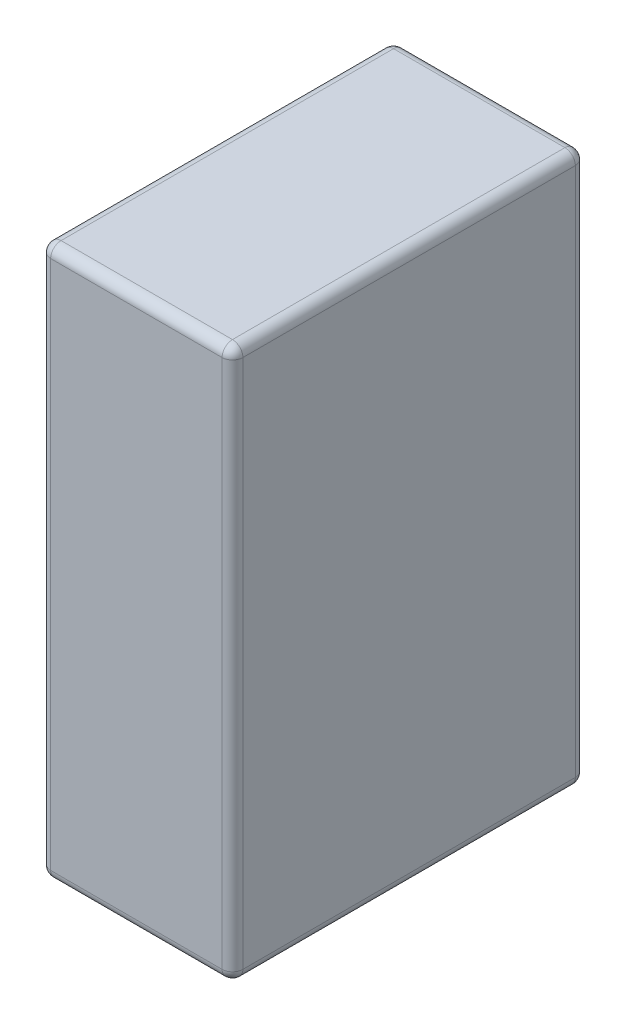
ISO-10303-21;
HEADER;
FILE_DESCRIPTION(('STEP AP214'),'2;1');
FILE_NAME('part.step','',(''),(''),'','','');
FILE_SCHEMA(('AUTOMOTIVE_DESIGN { 1 0 10303 214 1 1 1 1 }'));
ENDSEC;
DATA;
#1=APPLICATION_CONTEXT('core data for automotive mechanical design processes');
#2=APPLICATION_PROTOCOL_DEFINITION('international standard','automotive_design',2000,#1);
#3=PRODUCT_CONTEXT('',#1,'mechanical');
#4=PRODUCT('Part','Part','',(#3));
#5=PRODUCT_RELATED_PRODUCT_CATEGORY('part','',(#4));
#6=PRODUCT_DEFINITION_FORMATION('','',#4);
#7=PRODUCT_DEFINITION_CONTEXT('part definition',#1,'design');
#8=PRODUCT_DEFINITION('design','',#6,#7);
#9=PRODUCT_DEFINITION_SHAPE('','',#8);
#10=(LENGTH_UNIT() NAMED_UNIT(*) SI_UNIT(.MILLI.,.METRE.));
#11=(NAMED_UNIT(*) PLANE_ANGLE_UNIT() SI_UNIT($,.RADIAN.));
#12=(NAMED_UNIT(*) SI_UNIT($,.STERADIAN.) SOLID_ANGLE_UNIT());
#13=UNCERTAINTY_MEASURE_WITH_UNIT(LENGTH_MEASURE(1.E-05),#10,'distance_accuracy_value','');
#14=(GEOMETRIC_REPRESENTATION_CONTEXT(3) GLOBAL_UNCERTAINTY_ASSIGNED_CONTEXT((#13)) GLOBAL_UNIT_ASSIGNED_CONTEXT((#10,
#11,#12)) REPRESENTATION_CONTEXT('',''));
#15=CARTESIAN_POINT('',(0.,0.,0.));
#16=DIRECTION('',(0.,0.,1.));
#17=DIRECTION('',(1.,0.,0.));
#18=AXIS2_PLACEMENT_3D('',#15,#16,#17);
#19=CARTESIAN_POINT('',(-16.5,-51.,32.));
#20=DIRECTION('',(1.,0.,0.));
#21=DIRECTION('',(0.,0.,1.));
#22=AXIS2_PLACEMENT_3D('',#19,#20,#21);
#23=SPHERICAL_SURFACE('',#22,2.);
#24=CARTESIAN_POINT('',(-16.5,-51.,32.));
#25=DIRECTION('',(-1.,0.,0.));
#26=DIRECTION('',(0.,0.,1.));
#27=AXIS2_PLACEMENT_3D('',#24,#25,#26);
#28=CIRCLE('',#27,2.);
#29=CARTESIAN_POINT('',(-16.5,-51.0000000000245,34.));
#30=VERTEX_POINT('',#29);
#31=CARTESIAN_POINT('',(-16.5,-53.,32.));
#32=VERTEX_POINT('',#31);
#33=EDGE_CURVE('E169',#30,#32,#28,.F.);
#34=ORIENTED_EDGE('',*,*,#33,.F.);
#35=CARTESIAN_POINT('',(-16.5,-51.,32.));
#36=DIRECTION('',(0.,-1.,0.));
#37=DIRECTION('',(0.,0.,-1.));
#38=AXIS2_PLACEMENT_3D('',#35,#36,#37);
#39=CIRCLE('',#38,2.);
#40=CARTESIAN_POINT('',(-18.5,-51.,32.));
#41=VERTEX_POINT('',#40);
#42=EDGE_CURVE('E166',#41,#30,#39,.F.);
#43=ORIENTED_EDGE('',*,*,#42,.F.);
#44=CARTESIAN_POINT('',(-16.5,-51.,32.));
#45=DIRECTION('',(0.,0.,-1.));
#46=DIRECTION('',(-1.,0.,0.));
#47=AXIS2_PLACEMENT_3D('',#44,#45,#46);
#48=CIRCLE('',#47,2.);
#49=EDGE_CURVE('E173',#32,#41,#48,.T.);
#50=ORIENTED_EDGE('',*,*,#49,.F.);
#51=EDGE_LOOP('',(#34,#43,#50));
#52=FACE_BOUND('',#51,.T.);
#53=ADVANCED_FACE('F19',(#52),#23,.T.);
#54=CARTESIAN_POINT('',(-16.5,51.,32.));
#55=DIRECTION('',(1.,0.,0.));
#56=DIRECTION('',(0.,1.,0.));
#57=AXIS2_PLACEMENT_3D('',#54,#55,#56);
#58=SPHERICAL_SURFACE('',#57,2.);
#59=CARTESIAN_POINT('',(-16.5,51.,32.));
#60=DIRECTION('',(0.,0.,1.));
#61=DIRECTION('',(1.,0.,0.));
#62=AXIS2_PLACEMENT_3D('',#59,#60,#61);
#63=CIRCLE('',#62,2.);
#64=CARTESIAN_POINT('',(-18.5,51.0000000000736,32.));
#65=VERTEX_POINT('',#64);
#66=CARTESIAN_POINT('',(-16.5,53.,32.));
#67=VERTEX_POINT('',#66);
#68=EDGE_CURVE('E187',#65,#67,#63,.F.);
#69=ORIENTED_EDGE('',*,*,#68,.F.);
#70=CARTESIAN_POINT('',(-16.5,51.0000000000981,32.));
#71=DIRECTION('',(0.,-1.,0.));
#72=DIRECTION('',(0.,0.,-1.));
#73=AXIS2_PLACEMENT_3D('',#70,#71,#72);
#74=CIRCLE('',#73,2.);
#75=CARTESIAN_POINT('',(-16.5,51.0000000000981,34.));
#76=VERTEX_POINT('',#75);
#77=EDGE_CURVE('E175',#76,#65,#74,.T.);
#78=ORIENTED_EDGE('',*,*,#77,.F.);
#79=CARTESIAN_POINT('',(-16.5,51.,32.));
#80=DIRECTION('',(1.,0.,0.));
#81=DIRECTION('',(0.,0.,-1.));
#82=AXIS2_PLACEMENT_3D('',#79,#80,#81);
#83=CIRCLE('',#82,2.);
#84=EDGE_CURVE('E189',#67,#76,#83,.T.);
#85=ORIENTED_EDGE('',*,*,#84,.F.);
#86=EDGE_LOOP('',(#69,#78,#85));
#87=FACE_BOUND('',#86,.T.);
#88=ADVANCED_FACE('F307',(#87),#58,.T.);
#89=CARTESIAN_POINT('',(-16.5,51.,-32.));
#90=DIRECTION('',(1.,0.,0.));
#91=DIRECTION('',(0.,0.,-1.));
#92=AXIS2_PLACEMENT_3D('',#89,#90,#91);
#93=SPHERICAL_SURFACE('',#92,2.);
#94=CARTESIAN_POINT('',(-16.5,51.,-32.));
#95=DIRECTION('',(-1.,0.,0.));
#96=DIRECTION('',(0.,0.,1.));
#97=AXIS2_PLACEMENT_3D('',#94,#95,#96);
#98=CIRCLE('',#97,2.);
#99=CARTESIAN_POINT('',(-16.5,51.,-34.));
#100=VERTEX_POINT('',#99);
#101=CARTESIAN_POINT('',(-16.5,53.,-32.0000000001563));
#102=VERTEX_POINT('',#101);
#103=EDGE_CURVE('E242',#100,#102,#98,.F.);
#104=ORIENTED_EDGE('',*,*,#103,.F.);
#105=CARTESIAN_POINT('',(-16.5,51.,-32.));
#106=DIRECTION('',(0.,-1.,0.));
#107=DIRECTION('',(0.,0.,-1.));
#108=AXIS2_PLACEMENT_3D('',#105,#106,#107);
#109=CIRCLE('',#108,2.);
#110=CARTESIAN_POINT('',(-18.5,51.,-32.));
#111=VERTEX_POINT('',#110);
#112=EDGE_CURVE('E219',#111,#100,#109,.T.);
#113=ORIENTED_EDGE('',*,*,#112,.F.);
#114=CARTESIAN_POINT('',(-16.5,51.,-32.));
#115=DIRECTION('',(0.,0.,1.));
#116=DIRECTION('',(1.,0.,0.));
#117=AXIS2_PLACEMENT_3D('',#114,#115,#116);
#118=CIRCLE('',#117,2.);
#119=EDGE_CURVE('E195',#102,#111,#118,.T.);
#120=ORIENTED_EDGE('',*,*,#119,.F.);
#121=EDGE_LOOP('',(#104,#113,#120));
#122=FACE_BOUND('',#121,.T.);
#123=ADVANCED_FACE('F397',(#122),#93,.T.);
#124=CARTESIAN_POINT('',(-16.5,-51.,-32.));
#125=DIRECTION('',(1.,0.,0.));
#126=DIRECTION('',(0.,-1.,0.));
#127=AXIS2_PLACEMENT_3D('',#124,#125,#126);
#128=SPHERICAL_SURFACE('',#127,1.99999999999998);
#129=CARTESIAN_POINT('',(-16.5,-51.,-32.));
#130=DIRECTION('',(0.,-1.,0.));
#131=DIRECTION('',(0.,0.,-1.));
#132=AXIS2_PLACEMENT_3D('',#129,#130,#131);
#133=CIRCLE('',#132,2.);
#134=CARTESIAN_POINT('',(-16.5,-51.0000000002923,-34.));
#135=VERTEX_POINT('',#134);
#136=CARTESIAN_POINT('',(-18.5,-51.,-32.));
#137=VERTEX_POINT('',#136);
#138=EDGE_CURVE('E214',#135,#137,#133,.F.);
#139=ORIENTED_EDGE('',*,*,#138,.F.);
#140=CARTESIAN_POINT('',(-16.5,-51.,-32.));
#141=DIRECTION('',(1.,0.,0.));
#142=DIRECTION('',(0.,0.,-1.));
#143=AXIS2_PLACEMENT_3D('',#140,#141,#142);
#144=CIRCLE('',#143,2.);
#145=CARTESIAN_POINT('',(-16.5,-53.,-32.));
#146=VERTEX_POINT('',#145);
#147=EDGE_CURVE('E202',#146,#135,#144,.T.);
#148=ORIENTED_EDGE('',*,*,#147,.F.);
#149=CARTESIAN_POINT('',(-16.5,-51.,-32.));
#150=DIRECTION('',(0.,0.,-1.));
#151=DIRECTION('',(-1.,0.,0.));
#152=AXIS2_PLACEMENT_3D('',#149,#150,#151);
#153=CIRCLE('',#152,2.);
#154=EDGE_CURVE('E176',#137,#146,#153,.F.);
#155=ORIENTED_EDGE('',*,*,#154,.F.);
#156=EDGE_LOOP('',(#139,#148,#155));
#157=FACE_BOUND('',#156,.T.);
#158=ADVANCED_FACE('F237',(#157),#128,.T.);
#159=CARTESIAN_POINT('',(-18.5,53.,-34.));
#160=DIRECTION('',(1.,0.,0.));
#161=DIRECTION('',(0.,0.,-1.));
#162=AXIS2_PLACEMENT_3D('',#159,#160,#161);
#163=PLANE('',#162);
#164=DIRECTION('',(0.,0.,1.));
#165=VECTOR('',#164,1.);
#166=CARTESIAN_POINT('',(-18.5,51.,0.));
#167=LINE('',#166,#165);
#168=EDGE_CURVE('E190',#111,#65,#167,.T.);
#169=ORIENTED_EDGE('',*,*,#168,.F.);
#170=DIRECTION('',(0.,-1.,0.));
#171=VECTOR('',#170,1.);
#172=CARTESIAN_POINT('',(-18.5,53.,-32.));
#173=LINE('',#172,#171);
#174=EDGE_CURVE('E150',#137,#111,#173,.F.);
#175=ORIENTED_EDGE('',*,*,#174,.F.);
#176=DIRECTION('',(0.,0.,-1.));
#177=VECTOR('',#176,1.);
#178=CARTESIAN_POINT('',(-18.5,-51.,-34.));
#179=LINE('',#178,#177);
#180=EDGE_CURVE('E208',#41,#137,#179,.T.);
#181=ORIENTED_EDGE('',*,*,#180,.F.);
#182=DIRECTION('',(0.,-1.,0.));
#183=VECTOR('',#182,1.);
#184=CARTESIAN_POINT('',(-18.5,53.,32.));
#185=LINE('',#184,#183);
#186=EDGE_CURVE('E170',#65,#41,#185,.T.);
#187=ORIENTED_EDGE('',*,*,#186,.F.);
#188=EDGE_LOOP('',(#169,#175,#181,#187));
#189=FACE_BOUND('',#188,.T.);
#190=ADVANCED_FACE('F268',(#189),#163,.F.);
#191=CARTESIAN_POINT('',(-16.5,-51.,-34.));
#192=DIRECTION('',(0.,0.,-1.));
#193=DIRECTION('',(-1.,0.,0.));
#194=AXIS2_PLACEMENT_3D('',#191,#192,#193);
#195=CYLINDRICAL_SURFACE('',#194,2.);
#196=DIRECTION('',(0.,0.,-1.));
#197=VECTOR('',#196,1.);
#198=CARTESIAN_POINT('',(-16.5,-53.,0.));
#199=LINE('',#198,#197);
#200=EDGE_CURVE('E149',#32,#146,#199,.T.);
#201=ORIENTED_EDGE('',*,*,#200,.F.);
#202=ORIENTED_EDGE('',*,*,#49,.T.);
#203=ORIENTED_EDGE('',*,*,#180,.T.);
#204=ORIENTED_EDGE('',*,*,#154,.T.);
#205=EDGE_LOOP('',(#201,#202,#203,#204));
#206=FACE_BOUND('',#205,.T.);
#207=ADVANCED_FACE('F226',(#206),#195,.T.);
#208=CARTESIAN_POINT('',(-16.5,53.,32.));
#209=DIRECTION('',(0.,-1.,0.));
#210=DIRECTION('',(0.,0.,-1.));
#211=AXIS2_PLACEMENT_3D('',#208,#209,#210);
#212=CYLINDRICAL_SURFACE('',#211,2.);
#213=ORIENTED_EDGE('',*,*,#42,.T.);
#214=DIRECTION('',(0.,1.,0.));
#215=VECTOR('',#214,1.);
#216=CARTESIAN_POINT('',(-16.5,53.,34.));
#217=LINE('',#216,#215);
#218=EDGE_CURVE('E112',#30,#76,#217,.T.);
#219=ORIENTED_EDGE('',*,*,#218,.T.);
#220=ORIENTED_EDGE('',*,*,#77,.T.);
#221=ORIENTED_EDGE('',*,*,#186,.T.);
#222=EDGE_LOOP('',(#213,#219,#220,#221));
#223=FACE_BOUND('',#222,.T.);
#224=ADVANCED_FACE('F262',(#223),#212,.T.);
#225=CARTESIAN_POINT('',(18.5,-51.,32.));
#226=DIRECTION('',(-1.,0.,0.));
#227=DIRECTION('',(0.,0.,1.));
#228=AXIS2_PLACEMENT_3D('',#225,#226,#227);
#229=CYLINDRICAL_SURFACE('',#228,2.);
#230=DIRECTION('',(-1.,0.,0.));
#231=VECTOR('',#230,1.);
#232=CARTESIAN_POINT('',(18.5,-51.0000000000491,34.));
#233=LINE('',#232,#231);
#234=CARTESIAN_POINT('',(16.5,-51.0000000000245,34.));
#235=VERTEX_POINT('',#234);
#236=EDGE_CURVE('E23',#235,#30,#233,.T.);
#237=ORIENTED_EDGE('',*,*,#236,.T.);
#238=ORIENTED_EDGE('',*,*,#33,.T.);
#239=DIRECTION('',(1.,0.,0.));
#240=VECTOR('',#239,1.);
#241=CARTESIAN_POINT('',(0.,-53.,32.));
#242=LINE('',#241,#240);
#243=CARTESIAN_POINT('',(16.5,-53.,32.));
#244=VERTEX_POINT('',#243);
#245=EDGE_CURVE('E131',#244,#32,#242,.F.);
#246=ORIENTED_EDGE('',*,*,#245,.F.);
#247=CARTESIAN_POINT('',(16.5,-51.,32.));
#248=DIRECTION('',(1.,0.,0.));
#249=DIRECTION('',(0.,0.,-1.));
#250=AXIS2_PLACEMENT_3D('',#247,#248,#249);
#251=CIRCLE('',#250,1.99999999999999);
#252=EDGE_CURVE('E128',#235,#244,#251,.T.);
#253=ORIENTED_EDGE('',*,*,#252,.F.);
#254=EDGE_LOOP('',(#237,#238,#246,#253));
#255=FACE_BOUND('',#254,.T.);
#256=ADVANCED_FACE('F129',(#255),#229,.T.);
#257=CARTESIAN_POINT('',(-16.5,51.,0.));
#258=DIRECTION('',(0.,0.,1.));
#259=DIRECTION('',(1.,0.,0.));
#260=AXIS2_PLACEMENT_3D('',#257,#258,#259);
#261=CYLINDRICAL_SURFACE('',#260,2.);
#262=ORIENTED_EDGE('',*,*,#168,.T.);
#263=ORIENTED_EDGE('',*,*,#68,.T.);
#264=DIRECTION('',(0.,0.,-1.));
#265=VECTOR('',#264,1.);
#266=CARTESIAN_POINT('',(-16.5,53.,0.));
#267=LINE('',#266,#265);
#268=EDGE_CURVE('E134',#67,#102,#267,.T.);
#269=ORIENTED_EDGE('',*,*,#268,.T.);
#270=ORIENTED_EDGE('',*,*,#119,.T.);
#271=EDGE_LOOP('',(#262,#263,#269,#270));
#272=FACE_BOUND('',#271,.T.);
#273=ADVANCED_FACE('F300',(#272),#261,.T.);
#274=CARTESIAN_POINT('',(0.,51.,32.));
#275=DIRECTION('',(1.,0.,0.));
#276=DIRECTION('',(0.,0.,-1.));
#277=AXIS2_PLACEMENT_3D('',#274,#275,#276);
#278=CYLINDRICAL_SURFACE('',#277,2.);
#279=DIRECTION('',(1.,0.,0.));
#280=VECTOR('',#279,1.);
#281=CARTESIAN_POINT('',(0.,53.,32.));
#282=LINE('',#281,#280);
#283=CARTESIAN_POINT('',(16.5,53.,32.0000000000167));
#284=VERTEX_POINT('',#283);
#285=EDGE_CURVE('E289',#284,#67,#282,.F.);
#286=ORIENTED_EDGE('',*,*,#285,.T.);
#287=ORIENTED_EDGE('',*,*,#84,.T.);
#288=DIRECTION('',(-1.,0.,0.));
#289=VECTOR('',#288,1.);
#290=CARTESIAN_POINT('',(18.5,51.0000000000981,34.));
#291=LINE('',#290,#289);
#292=CARTESIAN_POINT('',(16.5,51.0000000000613,34.));
#293=VERTEX_POINT('',#292);
#294=EDGE_CURVE('E135',#76,#293,#291,.F.);
#295=ORIENTED_EDGE('',*,*,#294,.T.);
#296=CARTESIAN_POINT('',(16.5,51.,32.));
#297=DIRECTION('',(1.,0.,0.));
#298=DIRECTION('',(0.,0.,-1.));
#299=AXIS2_PLACEMENT_3D('',#296,#297,#298);
#300=CIRCLE('',#299,1.99999999999998);
#301=EDGE_CURVE('E287',#284,#293,#300,.T.);
#302=ORIENTED_EDGE('',*,*,#301,.F.);
#303=EDGE_LOOP('',(#286,#287,#295,#302));
#304=FACE_BOUND('',#303,.T.);
#305=ADVANCED_FACE('F310',(#304),#278,.T.);
#306=CARTESIAN_POINT('',(18.5,-51.,-32.));
#307=DIRECTION('',(1.,0.,0.));
#308=DIRECTION('',(0.,0.,-1.));
#309=AXIS2_PLACEMENT_3D('',#306,#307,#308);
#310=CYLINDRICAL_SURFACE('',#309,2.);
#311=DIRECTION('',(1.,0.,0.));
#312=VECTOR('',#311,1.);
#313=CARTESIAN_POINT('',(0.,-53.,-32.));
#314=LINE('',#313,#312);
#315=CARTESIAN_POINT('',(16.5,-53.,-32.));
#316=VERTEX_POINT('',#315);
#317=EDGE_CURVE('E115',#146,#316,#314,.T.);
#318=ORIENTED_EDGE('',*,*,#317,.F.);
#319=ORIENTED_EDGE('',*,*,#147,.T.);
#320=DIRECTION('',(1.,0.,0.));
#321=VECTOR('',#320,1.);
#322=CARTESIAN_POINT('',(18.5,-51.,-34.));
#323=LINE('',#322,#321);
#324=CARTESIAN_POINT('',(16.5,-51.,-34.));
#325=VERTEX_POINT('',#324);
#326=EDGE_CURVE('E278',#135,#325,#323,.T.);
#327=ORIENTED_EDGE('',*,*,#326,.T.);
#328=CARTESIAN_POINT('',(16.5,-51.,-32.));
#329=DIRECTION('',(1.,0.,0.));
#330=DIRECTION('',(0.,0.,-1.));
#331=AXIS2_PLACEMENT_3D('',#328,#329,#330);
#332=CIRCLE('',#331,2.00000000000002);
#333=EDGE_CURVE('E246',#316,#325,#332,.T.);
#334=ORIENTED_EDGE('',*,*,#333,.F.);
#335=EDGE_LOOP('',(#318,#319,#327,#334));
#336=FACE_BOUND('',#335,.T.);
#337=ADVANCED_FACE('F245',(#336),#310,.T.);
#338=CARTESIAN_POINT('',(0.,51.,-32.));
#339=DIRECTION('',(-1.,0.,0.));
#340=DIRECTION('',(0.,0.,1.));
#341=AXIS2_PLACEMENT_3D('',#338,#339,#340);
#342=CYLINDRICAL_SURFACE('',#341,2.);
#343=DIRECTION('',(1.,0.,0.));
#344=VECTOR('',#343,1.);
#345=CARTESIAN_POINT('',(18.5,51.,-34.));
#346=LINE('',#345,#344);
#347=CARTESIAN_POINT('',(16.5,51.0000000000599,-34.));
#348=VERTEX_POINT('',#347);
#349=EDGE_CURVE('E276',#348,#100,#346,.F.);
#350=ORIENTED_EDGE('',*,*,#349,.T.);
#351=ORIENTED_EDGE('',*,*,#103,.T.);
#352=DIRECTION('',(1.,0.,0.));
#353=VECTOR('',#352,1.);
#354=CARTESIAN_POINT('',(0.,53.,-32.));
#355=LINE('',#354,#353);
#356=CARTESIAN_POINT('',(16.5,53.,-32.));
#357=VERTEX_POINT('',#356);
#358=EDGE_CURVE('E291',#102,#357,#355,.T.);
#359=ORIENTED_EDGE('',*,*,#358,.T.);
#360=CARTESIAN_POINT('',(16.5,51.,-32.));
#361=DIRECTION('',(1.,0.,0.));
#362=DIRECTION('',(0.,1.,0.));
#363=AXIS2_PLACEMENT_3D('',#360,#361,#362);
#364=CIRCLE('',#363,2.00000000000001);
#365=EDGE_CURVE('E285',#348,#357,#364,.T.);
#366=ORIENTED_EDGE('',*,*,#365,.F.);
#367=EDGE_LOOP('',(#350,#351,#359,#366));
#368=FACE_BOUND('',#367,.T.);
#369=ADVANCED_FACE('F342',(#368),#342,.T.);
#370=CARTESIAN_POINT('',(-16.5,53.,-32.));
#371=DIRECTION('',(0.,-1.,0.));
#372=DIRECTION('',(0.,0.,-1.));
#373=AXIS2_PLACEMENT_3D('',#370,#371,#372);
#374=CYLINDRICAL_SURFACE('',#373,2.);
#375=ORIENTED_EDGE('',*,*,#138,.T.);
#376=ORIENTED_EDGE('',*,*,#174,.T.);
#377=ORIENTED_EDGE('',*,*,#112,.T.);
#378=DIRECTION('',(0.,1.,0.));
#379=VECTOR('',#378,1.);
#380=CARTESIAN_POINT('',(-16.5,53.,-34.));
#381=LINE('',#380,#379);
#382=EDGE_CURVE('E160',#100,#135,#381,.F.);
#383=ORIENTED_EDGE('',*,*,#382,.T.);
#384=EDGE_LOOP('',(#375,#376,#377,#383));
#385=FACE_BOUND('',#384,.T.);
#386=ADVANCED_FACE('F270',(#385),#374,.T.);
#387=CARTESIAN_POINT('',(0.,-53.,0.));
#388=DIRECTION('',(0.,-1.,0.));
#389=DIRECTION('',(0.,0.,-1.));
#390=AXIS2_PLACEMENT_3D('',#387,#388,#389);
#391=PLANE('',#390);
#392=ORIENTED_EDGE('',*,*,#200,.T.);
#393=ORIENTED_EDGE('',*,*,#317,.T.);
#394=DIRECTION('',(0.,0.,1.));
#395=VECTOR('',#394,1.);
#396=CARTESIAN_POINT('',(16.5,-53.,-34.));
#397=LINE('',#396,#395);
#398=EDGE_CURVE('E157',#244,#316,#397,.F.);
#399=ORIENTED_EDGE('',*,*,#398,.F.);
#400=ORIENTED_EDGE('',*,*,#245,.T.);
#401=EDGE_LOOP('',(#392,#393,#399,#400));
#402=FACE_BOUND('',#401,.T.);
#403=ADVANCED_FACE('F233',(#402),#391,.T.);
#404=CARTESIAN_POINT('',(18.5,53.,34.));
#405=DIRECTION('',(0.,0.,-1.));
#406=DIRECTION('',(-1.,0.,0.));
#407=AXIS2_PLACEMENT_3D('',#404,#405,#406);
#408=PLANE('',#407);
#409=ORIENTED_EDGE('',*,*,#294,.F.);
#410=ORIENTED_EDGE('',*,*,#218,.F.);
#411=ORIENTED_EDGE('',*,*,#236,.F.);
#412=DIRECTION('',(0.,-1.,0.));
#413=VECTOR('',#412,1.);
#414=CARTESIAN_POINT('',(16.5,53.,34.));
#415=LINE('',#414,#413);
#416=EDGE_CURVE('E110',#293,#235,#415,.T.);
#417=ORIENTED_EDGE('',*,*,#416,.F.);
#418=EDGE_LOOP('',(#409,#410,#411,#417));
#419=FACE_BOUND('',#418,.T.);
#420=ADVANCED_FACE('F109',(#419),#408,.F.);
#421=CARTESIAN_POINT('',(16.5,-51.,32.));
#422=DIRECTION('',(1.,0.,0.));
#423=DIRECTION('',(0.,1.2265945703018E-11,-1.));
#424=AXIS2_PLACEMENT_3D('',#421,#422,#423);
#425=SPHERICAL_SURFACE('',#424,2.);
#426=CARTESIAN_POINT('',(16.5,-51.,32.));
#427=DIRECTION('',(0.,0.,1.));
#428=DIRECTION('',(1.,0.,0.));
#429=AXIS2_PLACEMENT_3D('',#426,#427,#428);
#430=CIRCLE('',#429,2.);
#431=CARTESIAN_POINT('',(18.5,-51.0000000000061,32.));
#432=VERTEX_POINT('',#431);
#433=EDGE_CURVE('E138',#432,#244,#430,.F.);
#434=ORIENTED_EDGE('',*,*,#433,.F.);
#435=CARTESIAN_POINT('',(16.5,-51.0000000000491,32.));
#436=DIRECTION('',(0.,-1.,0.));
#437=DIRECTION('',(0.,0.,-1.));
#438=AXIS2_PLACEMENT_3D('',#435,#436,#437);
#439=CIRCLE('',#438,2.);
#440=EDGE_CURVE('E121',#235,#432,#439,.F.);
#441=ORIENTED_EDGE('',*,*,#440,.F.);
#442=ORIENTED_EDGE('',*,*,#252,.T.);
#443=EDGE_LOOP('',(#434,#441,#442));
#444=FACE_BOUND('',#443,.T.);
#445=ADVANCED_FACE('F137',(#444),#425,.T.);
#446=CARTESIAN_POINT('',(0.,53.,0.));
#447=DIRECTION('',(0.,-1.,0.));
#448=DIRECTION('',(0.,0.,-1.));
#449=AXIS2_PLACEMENT_3D('',#446,#447,#448);
#450=PLANE('',#449);
#451=DIRECTION('',(0.,0.,-1.));
#452=VECTOR('',#451,1.);
#453=CARTESIAN_POINT('',(16.5,53.,0.));
#454=LINE('',#453,#452);
#455=EDGE_CURVE('E143',#357,#284,#454,.F.);
#456=ORIENTED_EDGE('',*,*,#455,.F.);
#457=ORIENTED_EDGE('',*,*,#358,.F.);
#458=ORIENTED_EDGE('',*,*,#268,.F.);
#459=ORIENTED_EDGE('',*,*,#285,.F.);
#460=EDGE_LOOP('',(#456,#457,#458,#459));
#461=FACE_BOUND('',#460,.T.);
#462=ADVANCED_FACE('F304',(#461),#450,.F.);
#463=CARTESIAN_POINT('',(16.5,51.,32.));
#464=DIRECTION('',(1.,0.,0.));
#465=DIRECTION('',(0.,1.,0.));
#466=AXIS2_PLACEMENT_3D('',#463,#464,#465);
#467=SPHERICAL_SURFACE('',#466,2.);
#468=CARTESIAN_POINT('',(16.5,51.,32.));
#469=DIRECTION('',(0.,-1.,0.));
#470=DIRECTION('',(0.,0.,-1.));
#471=AXIS2_PLACEMENT_3D('',#468,#469,#470);
#472=CIRCLE('',#471,2.);
#473=CARTESIAN_POINT('',(18.5,51.,32.));
#474=VERTEX_POINT('',#473);
#475=EDGE_CURVE('E124',#474,#293,#472,.T.);
#476=ORIENTED_EDGE('',*,*,#475,.F.);
#477=CARTESIAN_POINT('',(16.5,51.,32.));
#478=DIRECTION('',(0.,0.,-1.));
#479=DIRECTION('',(-1.,0.,0.));
#480=AXIS2_PLACEMENT_3D('',#477,#478,#479);
#481=CIRCLE('',#480,2.);
#482=EDGE_CURVE('E313',#284,#474,#481,.T.);
#483=ORIENTED_EDGE('',*,*,#482,.F.);
#484=ORIENTED_EDGE('',*,*,#301,.T.);
#485=EDGE_LOOP('',(#476,#483,#484));
#486=FACE_BOUND('',#485,.T.);
#487=ADVANCED_FACE('F314',(#486),#467,.T.);
#488=CARTESIAN_POINT('',(16.5,51.,-32.));
#489=DIRECTION('',(1.,0.,0.));
#490=DIRECTION('',(0.,0.,1.));
#491=AXIS2_PLACEMENT_3D('',#488,#489,#490);
#492=SPHERICAL_SURFACE('',#491,2.);
#493=CARTESIAN_POINT('',(16.5,51.,-32.));
#494=DIRECTION('',(0.,0.,-1.));
#495=DIRECTION('',(-1.,0.,0.));
#496=AXIS2_PLACEMENT_3D('',#493,#494,#495);
#497=CIRCLE('',#496,2.);
#498=CARTESIAN_POINT('',(18.5,51.,-32.));
#499=VERTEX_POINT('',#498);
#500=EDGE_CURVE('E140',#499,#357,#497,.F.);
#501=ORIENTED_EDGE('',*,*,#500,.F.);
#502=CARTESIAN_POINT('',(16.5,51.,-32.));
#503=DIRECTION('',(0.,-1.,0.));
#504=DIRECTION('',(0.,0.,-1.));
#505=AXIS2_PLACEMENT_3D('',#502,#503,#504);
#506=CIRCLE('',#505,2.);
#507=EDGE_CURVE('E37',#348,#499,#506,.T.);
#508=ORIENTED_EDGE('',*,*,#507,.F.);
#509=ORIENTED_EDGE('',*,*,#365,.T.);
#510=EDGE_LOOP('',(#501,#508,#509));
#511=FACE_BOUND('',#510,.T.);
#512=ADVANCED_FACE('F344',(#511),#492,.T.);
#513=CARTESIAN_POINT('',(16.5,-51.,-32.));
#514=DIRECTION('',(1.,0.,0.));
#515=DIRECTION('',(0.,1.,0.));
#516=AXIS2_PLACEMENT_3D('',#513,#514,#515);
#517=SPHERICAL_SURFACE('',#516,2.);
#518=ORIENTED_EDGE('',*,*,#333,.T.);
#519=CARTESIAN_POINT('',(16.5,-51.,-32.));
#520=DIRECTION('',(0.,-1.,0.));
#521=DIRECTION('',(0.,0.,-1.));
#522=AXIS2_PLACEMENT_3D('',#519,#520,#521);
#523=CIRCLE('',#522,2.);
#524=CARTESIAN_POINT('',(18.5,-51.,-32.));
#525=VERTEX_POINT('',#524);
#526=EDGE_CURVE('E319',#525,#325,#523,.F.);
#527=ORIENTED_EDGE('',*,*,#526,.F.);
#528=CARTESIAN_POINT('',(16.5,-51.,-32.));
#529=DIRECTION('',(0.,0.,1.));
#530=DIRECTION('',(1.,0.,0.));
#531=AXIS2_PLACEMENT_3D('',#528,#529,#530);
#532=CIRCLE('',#531,2.);
#533=EDGE_CURVE('E154',#316,#525,#532,.T.);
#534=ORIENTED_EDGE('',*,*,#533,.F.);
#535=EDGE_LOOP('',(#518,#527,#534));
#536=FACE_BOUND('',#535,.T.);
#537=ADVANCED_FACE('F21',(#536),#517,.T.);
#538=CARTESIAN_POINT('',(18.5,53.,-34.));
#539=DIRECTION('',(0.,0.,1.));
#540=DIRECTION('',(1.,0.,0.));
#541=AXIS2_PLACEMENT_3D('',#538,#539,#540);
#542=PLANE('',#541);
#543=ORIENTED_EDGE('',*,*,#349,.F.);
#544=DIRECTION('',(0.,-1.,0.));
#545=VECTOR('',#544,1.);
#546=CARTESIAN_POINT('',(16.5,53.,-34.));
#547=LINE('',#546,#545);
#548=EDGE_CURVE('E325',#325,#348,#547,.F.);
#549=ORIENTED_EDGE('',*,*,#548,.F.);
#550=ORIENTED_EDGE('',*,*,#326,.F.);
#551=ORIENTED_EDGE('',*,*,#382,.F.);
#552=EDGE_LOOP('',(#543,#549,#550,#551));
#553=FACE_BOUND('',#552,.T.);
#554=ADVANCED_FACE('F341',(#553),#542,.F.);
#555=CARTESIAN_POINT('',(16.5,-51.,-34.));
#556=DIRECTION('',(0.,0.,1.));
#557=DIRECTION('',(1.,0.,0.));
#558=AXIS2_PLACEMENT_3D('',#555,#556,#557);
#559=CYLINDRICAL_SURFACE('',#558,2.);
#560=DIRECTION('',(0.,0.,1.));
#561=VECTOR('',#560,1.);
#562=CARTESIAN_POINT('',(18.5,-51.,-34.));
#563=LINE('',#562,#561);
#564=EDGE_CURVE('E327',#525,#432,#563,.T.);
#565=ORIENTED_EDGE('',*,*,#564,.T.);
#566=ORIENTED_EDGE('',*,*,#433,.T.);
#567=ORIENTED_EDGE('',*,*,#398,.T.);
#568=ORIENTED_EDGE('',*,*,#533,.T.);
#569=EDGE_LOOP('',(#565,#566,#567,#568));
#570=FACE_BOUND('',#569,.T.);
#571=ADVANCED_FACE('F363',(#570),#559,.T.);
#572=CARTESIAN_POINT('',(16.5,53.,32.));
#573=DIRECTION('',(0.,-1.,0.));
#574=DIRECTION('',(0.,0.,-1.));
#575=AXIS2_PLACEMENT_3D('',#572,#573,#574);
#576=CYLINDRICAL_SURFACE('',#575,2.);
#577=ORIENTED_EDGE('',*,*,#440,.T.);
#578=DIRECTION('',(0.,1.,0.));
#579=VECTOR('',#578,1.);
#580=CARTESIAN_POINT('',(18.5,53.,32.));
#581=LINE('',#580,#579);
#582=EDGE_CURVE('E330',#432,#474,#581,.T.);
#583=ORIENTED_EDGE('',*,*,#582,.T.);
#584=ORIENTED_EDGE('',*,*,#475,.T.);
#585=ORIENTED_EDGE('',*,*,#416,.T.);
#586=EDGE_LOOP('',(#577,#583,#584,#585));
#587=FACE_BOUND('',#586,.T.);
#588=ADVANCED_FACE('F118',(#587),#576,.T.);
#589=CARTESIAN_POINT('',(16.5,51.,0.));
#590=DIRECTION('',(0.,0.,-1.));
#591=DIRECTION('',(-1.,0.,0.));
#592=AXIS2_PLACEMENT_3D('',#589,#590,#591);
#593=CYLINDRICAL_SURFACE('',#592,2.);
#594=ORIENTED_EDGE('',*,*,#455,.T.);
#595=ORIENTED_EDGE('',*,*,#482,.T.);
#596=DIRECTION('',(0.,0.,1.));
#597=VECTOR('',#596,1.);
#598=CARTESIAN_POINT('',(18.5,51.,-34.));
#599=LINE('',#598,#597);
#600=EDGE_CURVE('E29',#474,#499,#599,.F.);
#601=ORIENTED_EDGE('',*,*,#600,.T.);
#602=ORIENTED_EDGE('',*,*,#500,.T.);
#603=EDGE_LOOP('',(#594,#595,#601,#602));
#604=FACE_BOUND('',#603,.T.);
#605=ADVANCED_FACE('F332',(#604),#593,.T.);
#606=CARTESIAN_POINT('',(16.5,53.,-32.));
#607=DIRECTION('',(0.,-1.,0.));
#608=DIRECTION('',(0.,0.,-1.));
#609=AXIS2_PLACEMENT_3D('',#606,#607,#608);
#610=CYLINDRICAL_SURFACE('',#609,2.);
#611=ORIENTED_EDGE('',*,*,#526,.T.);
#612=ORIENTED_EDGE('',*,*,#548,.T.);
#613=ORIENTED_EDGE('',*,*,#507,.T.);
#614=DIRECTION('',(0.,1.,0.));
#615=VECTOR('',#614,1.);
#616=CARTESIAN_POINT('',(18.5,53.,-32.));
#617=LINE('',#616,#615);
#618=EDGE_CURVE('E12',#499,#525,#617,.F.);
#619=ORIENTED_EDGE('',*,*,#618,.T.);
#620=EDGE_LOOP('',(#611,#612,#613,#619));
#621=FACE_BOUND('',#620,.T.);
#622=ADVANCED_FACE('F338',(#621),#610,.T.);
#623=CARTESIAN_POINT('',(18.5,53.,-34.));
#624=DIRECTION('',(-1.,0.,0.));
#625=DIRECTION('',(0.,0.,1.));
#626=AXIS2_PLACEMENT_3D('',#623,#624,#625);
#627=PLANE('',#626);
#628=ORIENTED_EDGE('',*,*,#600,.F.);
#629=ORIENTED_EDGE('',*,*,#582,.F.);
#630=ORIENTED_EDGE('',*,*,#564,.F.);
#631=ORIENTED_EDGE('',*,*,#618,.F.);
#632=EDGE_LOOP('',(#628,#629,#630,#631));
#633=FACE_BOUND('',#632,.T.);
#634=ADVANCED_FACE('F335',(#633),#627,.F.);
#635=CLOSED_SHELL('',(#53,#88,#123,#158,#190,#207,#224,#256,#273,#305,#337,#369,#386,#403,#420,
#445,#462,#487,#512,#537,#554,#571,#588,#605,#622,#634));
#636=MANIFOLD_SOLID_BREP('B1',#635);
#637=ADVANCED_BREP_SHAPE_REPRESENTATION('',(#18,#636),#14);
#638=SHAPE_DEFINITION_REPRESENTATION(#9,#637);
ENDSEC;
END-ISO-10303-21;
